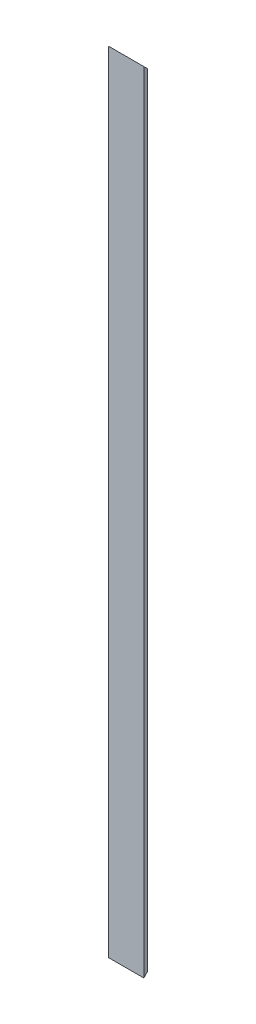
ISO-10303-21;
HEADER;
FILE_DESCRIPTION(('STEP AP214'),'2;1');
FILE_NAME('part.step','',(''),(''),'','','');
FILE_SCHEMA(('AUTOMOTIVE_DESIGN { 1 0 10303 214 1 1 1 1 }'));
ENDSEC;
DATA;
#1=APPLICATION_CONTEXT('core data for automotive mechanical design processes');
#2=APPLICATION_PROTOCOL_DEFINITION('international standard','automotive_design',2000,#1);
#3=PRODUCT_CONTEXT('',#1,'mechanical');
#4=PRODUCT('Part','Part','',(#3));
#5=PRODUCT_RELATED_PRODUCT_CATEGORY('part','',(#4));
#6=PRODUCT_DEFINITION_FORMATION('','',#4);
#7=PRODUCT_DEFINITION_CONTEXT('part definition',#1,'design');
#8=PRODUCT_DEFINITION('design','',#6,#7);
#9=PRODUCT_DEFINITION_SHAPE('','',#8);
#10=(LENGTH_UNIT() NAMED_UNIT(*) SI_UNIT(.MILLI.,.METRE.));
#11=(NAMED_UNIT(*) PLANE_ANGLE_UNIT() SI_UNIT($,.RADIAN.));
#12=(NAMED_UNIT(*) SI_UNIT($,.STERADIAN.) SOLID_ANGLE_UNIT());
#13=UNCERTAINTY_MEASURE_WITH_UNIT(LENGTH_MEASURE(1.E-05),#10,'distance_accuracy_value','');
#14=(GEOMETRIC_REPRESENTATION_CONTEXT(3) GLOBAL_UNCERTAINTY_ASSIGNED_CONTEXT((#13)) GLOBAL_UNIT_ASSIGNED_CONTEXT((#10,
#11,#12)) REPRESENTATION_CONTEXT('',''));
#15=CARTESIAN_POINT('',(0.,0.,0.));
#16=DIRECTION('',(0.,0.,1.));
#17=DIRECTION('',(1.,0.,0.));
#18=AXIS2_PLACEMENT_3D('',#15,#16,#17);
#19=CARTESIAN_POINT('',(0.,1000.,0.));
#20=DIRECTION('',(0.,0.,-1.));
#21=DIRECTION('',(-1.,0.,0.));
#22=AXIS2_PLACEMENT_3D('',#19,#20,#21);
#23=PLANE('',#22);
#24=DIRECTION('',(1.,0.,0.));
#25=VECTOR('',#24,1.);
#26=CARTESIAN_POINT('',(0.,0.,0.));
#27=LINE('',#26,#25);
#28=CARTESIAN_POINT('',(0.,0.,0.));
#29=VERTEX_POINT('',#28);
#30=CARTESIAN_POINT('',(45.,0.,0.));
#31=VERTEX_POINT('',#30);
#32=EDGE_CURVE('E102',#29,#31,#27,.T.);
#33=ORIENTED_EDGE('',*,*,#32,.T.);
#34=DIRECTION('',(0.,-1.,0.));
#35=VECTOR('',#34,1.);
#36=CARTESIAN_POINT('',(45.,1000.,0.));
#37=LINE('',#36,#35);
#38=CARTESIAN_POINT('',(45.,1000.,0.));
#39=VERTEX_POINT('',#38);
#40=EDGE_CURVE('E11',#39,#31,#37,.T.);
#41=ORIENTED_EDGE('',*,*,#40,.F.);
#42=DIRECTION('',(1.,0.,0.));
#43=VECTOR('',#42,1.);
#44=CARTESIAN_POINT('',(0.,1000.,0.));
#45=LINE('',#44,#43);
#46=CARTESIAN_POINT('',(0.,1000.,0.));
#47=VERTEX_POINT('',#46);
#48=EDGE_CURVE('E113',#47,#39,#45,.T.);
#49=ORIENTED_EDGE('',*,*,#48,.F.);
#50=DIRECTION('',(0.,-1.,0.));
#51=VECTOR('',#50,1.);
#52=CARTESIAN_POINT('',(0.,1000.,0.));
#53=LINE('',#52,#51);
#54=EDGE_CURVE('E119',#47,#29,#53,.T.);
#55=ORIENTED_EDGE('',*,*,#54,.T.);
#56=EDGE_LOOP('',(#33,#41,#49,#55));
#57=FACE_BOUND('',#56,.T.);
#58=ADVANCED_FACE('F42',(#57),#23,.F.);
#59=CARTESIAN_POINT('',(45.,1000.,-5.));
#60=DIRECTION('',(1.,0.,0.));
#61=DIRECTION('',(0.,0.,-1.));
#62=AXIS2_PLACEMENT_3D('',#59,#60,#61);
#63=PLANE('',#62);
#64=DIRECTION('',(0.,0.707106781186543,-0.707106781186552));
#65=VECTOR('',#64,1.);
#66=CARTESIAN_POINT('',(45.,0.,0.));
#67=LINE('',#66,#65);
#68=CARTESIAN_POINT('',(45.,4.99999999999991,-5.));
#69=VERTEX_POINT('',#68);
#70=EDGE_CURVE('E108',#31,#69,#67,.T.);
#71=ORIENTED_EDGE('',*,*,#70,.T.);
#72=DIRECTION('',(0.,-1.,0.));
#73=VECTOR('',#72,1.);
#74=CARTESIAN_POINT('',(45.,1000.,-5.));
#75=LINE('',#74,#73);
#76=CARTESIAN_POINT('',(45.,995.,-5.));
#77=VERTEX_POINT('',#76);
#78=EDGE_CURVE('E51',#77,#69,#75,.T.);
#79=ORIENTED_EDGE('',*,*,#78,.F.);
#80=DIRECTION('',(0.,0.707106781186543,0.707106781186552));
#81=VECTOR('',#80,1.);
#82=CARTESIAN_POINT('',(45.,1000.,0.));
#83=LINE('',#82,#81);
#84=EDGE_CURVE('E152',#77,#39,#83,.T.);
#85=ORIENTED_EDGE('',*,*,#84,.T.);
#86=ORIENTED_EDGE('',*,*,#40,.T.);
#87=EDGE_LOOP('',(#71,#79,#85,#86));
#88=FACE_BOUND('',#87,.T.);
#89=ADVANCED_FACE('F151',(#88),#63,.T.);
#90=CARTESIAN_POINT('',(0.,1000.,-5.));
#91=DIRECTION('',(0.,0.,-1.));
#92=DIRECTION('',(-1.,0.,0.));
#93=AXIS2_PLACEMENT_3D('',#90,#91,#92);
#94=PLANE('',#93);
#95=DIRECTION('',(1.,0.,0.));
#96=VECTOR('',#95,1.);
#97=CARTESIAN_POINT('',(0.,5.,-5.));
#98=LINE('',#97,#96);
#99=CARTESIAN_POINT('',(5.,4.99999999999989,-5.));
#100=VERTEX_POINT('',#99);
#101=EDGE_CURVE('E148',#100,#69,#98,.T.);
#102=ORIENTED_EDGE('',*,*,#101,.F.);
#103=DIRECTION('',(0.,-1.,0.));
#104=VECTOR('',#103,1.);
#105=CARTESIAN_POINT('',(5.,1000.,-5.));
#106=LINE('',#105,#104);
#107=CARTESIAN_POINT('',(5.,995.,-5.));
#108=VERTEX_POINT('',#107);
#109=EDGE_CURVE('E138',#108,#100,#106,.T.);
#110=ORIENTED_EDGE('',*,*,#109,.F.);
#111=DIRECTION('',(-1.,0.,0.));
#112=VECTOR('',#111,1.);
#113=CARTESIAN_POINT('',(0.,995.,-5.));
#114=LINE('',#113,#112);
#115=EDGE_CURVE('E114',#77,#108,#114,.T.);
#116=ORIENTED_EDGE('',*,*,#115,.F.);
#117=ORIENTED_EDGE('',*,*,#78,.T.);
#118=EDGE_LOOP('',(#102,#110,#116,#117));
#119=FACE_BOUND('',#118,.T.);
#120=ADVANCED_FACE('F146',(#119),#94,.T.);
#121=CARTESIAN_POINT('',(5.,1000.,-45.));
#122=DIRECTION('',(1.,0.,0.));
#123=DIRECTION('',(0.,0.,-1.));
#124=AXIS2_PLACEMENT_3D('',#121,#122,#123);
#125=PLANE('',#124);
#126=DIRECTION('',(0.,-0.707106781186544,0.707106781186552));
#127=VECTOR('',#126,1.);
#128=CARTESIAN_POINT('',(4.99999999999998,522.499999999994,-522.5));
#129=LINE('',#128,#127);
#130=CARTESIAN_POINT('',(5.00000000000001,44.9999999999995,-45.));
#131=VERTEX_POINT('',#130);
#132=EDGE_CURVE('E158',#131,#100,#129,.T.);
#133=ORIENTED_EDGE('',*,*,#132,.F.);
#134=DIRECTION('',(0.,-1.,0.));
#135=VECTOR('',#134,1.);
#136=CARTESIAN_POINT('',(5.,1000.,-45.));
#137=LINE('',#136,#135);
#138=CARTESIAN_POINT('',(5.00000000000001,955.000000000001,-45.));
#139=VERTEX_POINT('',#138);
#140=EDGE_CURVE('E130',#139,#131,#137,.T.);
#141=ORIENTED_EDGE('',*,*,#140,.F.);
#142=DIRECTION('',(0.,-0.707106781186544,-0.707106781186552));
#143=VECTOR('',#142,1.);
#144=CARTESIAN_POINT('',(5.,977.5,-22.5000000000003));
#145=LINE('',#144,#143);
#146=EDGE_CURVE('E171',#108,#139,#145,.T.);
#147=ORIENTED_EDGE('',*,*,#146,.F.);
#148=ORIENTED_EDGE('',*,*,#109,.T.);
#149=EDGE_LOOP('',(#133,#141,#147,#148));
#150=FACE_BOUND('',#149,.T.);
#151=ADVANCED_FACE('F180',(#150),#125,.T.);
#152=CARTESIAN_POINT('',(0.,1000.,-45.));
#153=DIRECTION('',(0.,0.,-1.));
#154=DIRECTION('',(-1.,0.,0.));
#155=AXIS2_PLACEMENT_3D('',#152,#153,#154);
#156=PLANE('',#155);
#157=DIRECTION('',(-1.,0.,0.));
#158=VECTOR('',#157,1.);
#159=CARTESIAN_POINT('',(45.,44.9999999999995,-45.));
#160=LINE('',#159,#158);
#161=CARTESIAN_POINT('',(0.,44.9999999999995,-45.));
#162=VERTEX_POINT('',#161);
#163=EDGE_CURVE('E154',#131,#162,#160,.T.);
#164=ORIENTED_EDGE('',*,*,#163,.T.);
#165=DIRECTION('',(0.,-1.,0.));
#166=VECTOR('',#165,1.);
#167=CARTESIAN_POINT('',(0.,1000.,-45.));
#168=LINE('',#167,#166);
#169=CARTESIAN_POINT('',(0.,955.000000000001,-45.));
#170=VERTEX_POINT('',#169);
#171=EDGE_CURVE('E122',#170,#162,#168,.T.);
#172=ORIENTED_EDGE('',*,*,#171,.F.);
#173=DIRECTION('',(-1.,0.,0.));
#174=VECTOR('',#173,1.);
#175=CARTESIAN_POINT('',(45.,955.000000000001,-45.));
#176=LINE('',#175,#174);
#177=EDGE_CURVE('E124',#139,#170,#176,.T.);
#178=ORIENTED_EDGE('',*,*,#177,.F.);
#179=ORIENTED_EDGE('',*,*,#140,.T.);
#180=EDGE_LOOP('',(#164,#172,#178,#179));
#181=FACE_BOUND('',#180,.T.);
#182=ADVANCED_FACE('F182',(#181),#156,.T.);
#183=CARTESIAN_POINT('',(0.,1000.,-45.));
#184=DIRECTION('',(1.,0.,0.));
#185=DIRECTION('',(0.,0.,-1.));
#186=AXIS2_PLACEMENT_3D('',#183,#184,#185);
#187=PLANE('',#186);
#188=ORIENTED_EDGE('',*,*,#171,.T.);
#189=DIRECTION('',(0.,0.707106781186543,-0.707106781186552));
#190=VECTOR('',#189,1.);
#191=CARTESIAN_POINT('',(0.,0.,0.));
#192=LINE('',#191,#190);
#193=EDGE_CURVE('E105',#29,#162,#192,.T.);
#194=ORIENTED_EDGE('',*,*,#193,.F.);
#195=ORIENTED_EDGE('',*,*,#54,.F.);
#196=DIRECTION('',(0.,0.707106781186543,0.707106781186552));
#197=VECTOR('',#196,1.);
#198=CARTESIAN_POINT('',(0.,1000.,0.));
#199=LINE('',#198,#197);
#200=EDGE_CURVE('E60',#170,#47,#199,.T.);
#201=ORIENTED_EDGE('',*,*,#200,.F.);
#202=EDGE_LOOP('',(#188,#194,#195,#201));
#203=FACE_BOUND('',#202,.T.);
#204=ADVANCED_FACE('F118',(#203),#187,.F.);
#205=CARTESIAN_POINT('',(45.,0.,0.));
#206=DIRECTION('',(0.,0.707106781186551,0.707106781186543));
#207=DIRECTION('',(0.,-0.707106781186544,0.707106781186552));
#208=AXIS2_PLACEMENT_3D('',#205,#206,#207);
#209=PLANE('',#208);
#210=ORIENTED_EDGE('',*,*,#101,.T.);
#211=ORIENTED_EDGE('',*,*,#70,.F.);
#212=ORIENTED_EDGE('',*,*,#32,.F.);
#213=ORIENTED_EDGE('',*,*,#193,.T.);
#214=ORIENTED_EDGE('',*,*,#163,.F.);
#215=ORIENTED_EDGE('',*,*,#132,.T.);
#216=EDGE_LOOP('',(#210,#211,#212,#213,#214,#215));
#217=FACE_BOUND('',#216,.T.);
#218=ADVANCED_FACE('F104',(#217),#209,.F.);
#219=CARTESIAN_POINT('',(45.,1000.,0.));
#220=DIRECTION('',(0.,-0.707106781186551,0.707106781186543));
#221=DIRECTION('',(0.,-0.707106781186544,-0.707106781186552));
#222=AXIS2_PLACEMENT_3D('',#219,#220,#221);
#223=PLANE('',#222);
#224=ORIENTED_EDGE('',*,*,#115,.T.);
#225=ORIENTED_EDGE('',*,*,#146,.T.);
#226=ORIENTED_EDGE('',*,*,#177,.T.);
#227=ORIENTED_EDGE('',*,*,#200,.T.);
#228=ORIENTED_EDGE('',*,*,#48,.T.);
#229=ORIENTED_EDGE('',*,*,#84,.F.);
#230=EDGE_LOOP('',(#224,#225,#226,#227,#228,#229));
#231=FACE_BOUND('',#230,.T.);
#232=ADVANCED_FACE('F175',(#231),#223,.F.);
#233=CLOSED_SHELL('',(#58,#89,#120,#151,#182,#204,#218,#232));
#234=MANIFOLD_SOLID_BREP('B2',#233);
#235=ADVANCED_BREP_SHAPE_REPRESENTATION('',(#18,#234),#14);
#236=SHAPE_DEFINITION_REPRESENTATION(#9,#235);
ENDSEC;
END-ISO-10303-21;
